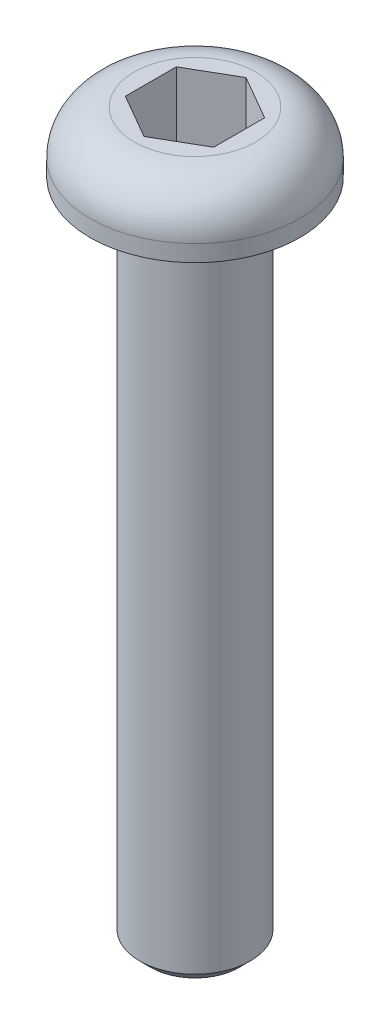
ISO-10303-21;
HEADER;
FILE_DESCRIPTION(('STEP AP214'),'2;1');
FILE_NAME('part.step','',(''),(''),'','','');
FILE_SCHEMA(('AUTOMOTIVE_DESIGN { 1 0 10303 214 1 1 1 1 }'));
ENDSEC;
DATA;
#1=APPLICATION_CONTEXT('core data for automotive mechanical design processes');
#2=APPLICATION_PROTOCOL_DEFINITION('international standard','automotive_design',2000,#1);
#3=PRODUCT_CONTEXT('',#1,'mechanical');
#4=PRODUCT('Part','Part','',(#3));
#5=PRODUCT_RELATED_PRODUCT_CATEGORY('part','',(#4));
#6=PRODUCT_DEFINITION_FORMATION('','',#4);
#7=PRODUCT_DEFINITION_CONTEXT('part definition',#1,'design');
#8=PRODUCT_DEFINITION('design','',#6,#7);
#9=PRODUCT_DEFINITION_SHAPE('','',#8);
#10=(LENGTH_UNIT() NAMED_UNIT(*) SI_UNIT(.MILLI.,.METRE.));
#11=(NAMED_UNIT(*) PLANE_ANGLE_UNIT() SI_UNIT($,.RADIAN.));
#12=(NAMED_UNIT(*) SI_UNIT($,.STERADIAN.) SOLID_ANGLE_UNIT());
#13=UNCERTAINTY_MEASURE_WITH_UNIT(LENGTH_MEASURE(1.E-05),#10,'distance_accuracy_value','');
#14=(GEOMETRIC_REPRESENTATION_CONTEXT(3) GLOBAL_UNCERTAINTY_ASSIGNED_CONTEXT((#13)) GLOBAL_UNIT_ASSIGNED_CONTEXT((#10,
#11,#12)) REPRESENTATION_CONTEXT('',''));
#15=CARTESIAN_POINT('',(0.,0.,0.));
#16=DIRECTION('',(0.,0.,1.));
#17=DIRECTION('',(1.,0.,0.));
#18=AXIS2_PLACEMENT_3D('',#15,#16,#17);
#19=CARTESIAN_POINT('',(0.,0.,0.));
#20=DIRECTION('',(0.,-1.,0.));
#21=DIRECTION('',(0.,0.,-1.));
#22=AXIS2_PLACEMENT_3D('',#19,#20,#21);
#23=PLANE('',#22);
#24=CARTESIAN_POINT('',(0.,0.,0.));
#25=DIRECTION('',(0.,-1.,0.));
#26=DIRECTION('',(0.,0.,-1.));
#27=AXIS2_PLACEMENT_3D('',#24,#25,#26);
#28=CIRCLE('',#27,2.75);
#29=CARTESIAN_POINT('',(0.,0.,-2.75));
#30=VERTEX_POINT('',#29);
#31=EDGE_CURVE('E43',#30,#30,#28,.F.);
#32=ORIENTED_EDGE('',*,*,#31,.T.);
#33=EDGE_LOOP('',(#32));
#34=FACE_BOUND('',#33,.T.);
#35=DIRECTION('',(-0.866025403784438,0.,-0.5));
#36=VECTOR('',#35,1.);
#37=CARTESIAN_POINT('',(2.,0.,-1.15470053837925));
#38=LINE('',#37,#36);
#39=CARTESIAN_POINT('',(2.,0.,-1.15470053837925));
#40=VERTEX_POINT('',#39);
#41=CARTESIAN_POINT('',(0.,0.,-2.3094010767585));
#42=VERTEX_POINT('',#41);
#43=EDGE_CURVE('E124',#40,#42,#38,.T.);
#44=ORIENTED_EDGE('',*,*,#43,.F.);
#45=DIRECTION('',(0.,0.,-1.));
#46=VECTOR('',#45,1.);
#47=CARTESIAN_POINT('',(2.,0.,1.15470053837925));
#48=LINE('',#47,#46);
#49=CARTESIAN_POINT('',(2.,0.,1.15470053837925));
#50=VERTEX_POINT('',#49);
#51=EDGE_CURVE('E50',#50,#40,#48,.T.);
#52=ORIENTED_EDGE('',*,*,#51,.F.);
#53=DIRECTION('',(0.866025403784438,0.,-0.5));
#54=VECTOR('',#53,1.);
#55=CARTESIAN_POINT('',(0.,0.,2.3094010767585));
#56=LINE('',#55,#54);
#57=CARTESIAN_POINT('',(0.,0.,2.3094010767585));
#58=VERTEX_POINT('',#57);
#59=EDGE_CURVE('E133',#58,#50,#56,.T.);
#60=ORIENTED_EDGE('',*,*,#59,.F.);
#61=DIRECTION('',(0.866025403784438,0.,0.5));
#62=VECTOR('',#61,1.);
#63=CARTESIAN_POINT('',(-2.,0.,1.15470053837925));
#64=LINE('',#63,#62);
#65=CARTESIAN_POINT('',(-2.,0.,1.15470053837925));
#66=VERTEX_POINT('',#65);
#67=EDGE_CURVE('E131',#66,#58,#64,.T.);
#68=ORIENTED_EDGE('',*,*,#67,.F.);
#69=DIRECTION('',(0.,0.,1.));
#70=VECTOR('',#69,1.);
#71=CARTESIAN_POINT('',(-2.,0.,-1.15470053837925));
#72=LINE('',#71,#70);
#73=CARTESIAN_POINT('',(-2.,0.,-1.15470053837925));
#74=VERTEX_POINT('',#73);
#75=EDGE_CURVE('E98',#74,#66,#72,.T.);
#76=ORIENTED_EDGE('',*,*,#75,.F.);
#77=DIRECTION('',(-0.866025403784439,0.,0.5));
#78=VECTOR('',#77,1.);
#79=CARTESIAN_POINT('',(0.,0.,-2.3094010767585));
#80=LINE('',#79,#78);
#81=EDGE_CURVE('E127',#42,#74,#80,.T.);
#82=ORIENTED_EDGE('',*,*,#81,.F.);
#83=EDGE_LOOP('',(#44,#52,#60,#68,#76,#82));
#84=FACE_BOUND('',#83,.T.);
#85=ADVANCED_FACE('F35',(#34,#84),#23,.F.);
#86=CARTESIAN_POINT('',(0.,0.,0.));
#87=DIRECTION('',(0.,1.,0.));
#88=DIRECTION('',(0.,0.,1.));
#89=AXIS2_PLACEMENT_3D('',#86,#87,#88);
#90=CYLINDRICAL_SURFACE('',#89,4.75);
#91=CARTESIAN_POINT('',(0.,-2.,0.));
#92=DIRECTION('',(0.,-1.,0.));
#93=DIRECTION('',(0.,0.,-1.));
#94=AXIS2_PLACEMENT_3D('',#91,#92,#93);
#95=CIRCLE('',#94,4.75);
#96=CARTESIAN_POINT('',(0.,-2.,-4.75));
#97=VERTEX_POINT('',#96);
#98=EDGE_CURVE('E11',#97,#97,#95,.T.);
#99=ORIENTED_EDGE('',*,*,#98,.T.);
#100=EDGE_LOOP('',(#99));
#101=FACE_BOUND('',#100,.T.);
#102=CARTESIAN_POINT('',(0.,-2.75,0.));
#103=DIRECTION('',(0.,1.,0.));
#104=DIRECTION('',(0.,0.,1.));
#105=AXIS2_PLACEMENT_3D('',#102,#103,#104);
#106=CIRCLE('',#105,4.75);
#107=CARTESIAN_POINT('',(0.,-2.75,4.75));
#108=VERTEX_POINT('',#107);
#109=EDGE_CURVE('E145',#108,#108,#106,.T.);
#110=ORIENTED_EDGE('',*,*,#109,.T.);
#111=EDGE_LOOP('',(#110));
#112=FACE_BOUND('',#111,.T.);
#113=ADVANCED_FACE('F167',(#101,#112),#90,.T.);
#114=CARTESIAN_POINT('',(4.75,-2.75,0.));
#115=DIRECTION('',(0.,1.,0.));
#116=DIRECTION('',(0.,0.,1.));
#117=AXIS2_PLACEMENT_3D('',#114,#115,#116);
#118=PLANE('',#117);
#119=ORIENTED_EDGE('',*,*,#109,.F.);
#120=EDGE_LOOP('',(#119));
#121=FACE_BOUND('',#120,.T.);
#122=CARTESIAN_POINT('',(0.,-2.75,0.));
#123=DIRECTION('',(0.,1.,0.));
#124=DIRECTION('',(0.,0.,1.));
#125=AXIS2_PLACEMENT_3D('',#122,#123,#124);
#126=CIRCLE('',#125,2.5);
#127=CARTESIAN_POINT('',(0.,-2.75,2.5));
#128=VERTEX_POINT('',#127);
#129=EDGE_CURVE('E137',#128,#128,#126,.T.);
#130=ORIENTED_EDGE('',*,*,#129,.T.);
#131=EDGE_LOOP('',(#130));
#132=FACE_BOUND('',#131,.T.);
#133=ADVANCED_FACE('F172',(#121,#132),#118,.F.);
#134=CARTESIAN_POINT('',(0.,0.,0.));
#135=DIRECTION('',(0.,1.,0.));
#136=DIRECTION('',(0.,0.,1.));
#137=AXIS2_PLACEMENT_3D('',#134,#135,#136);
#138=CYLINDRICAL_SURFACE('',#137,2.5);
#139=CARTESIAN_POINT('',(0.,-32.25,0.));
#140=DIRECTION('',(0.,1.,0.));
#141=DIRECTION('',(0.,0.,1.));
#142=AXIS2_PLACEMENT_3D('',#139,#140,#141);
#143=CIRCLE('',#142,2.5);
#144=CARTESIAN_POINT('',(0.,-32.25,2.5));
#145=VERTEX_POINT('',#144);
#146=EDGE_CURVE('E148',#145,#145,#143,.T.);
#147=ORIENTED_EDGE('',*,*,#146,.T.);
#148=EDGE_LOOP('',(#147));
#149=FACE_BOUND('',#148,.T.);
#150=ORIENTED_EDGE('',*,*,#129,.F.);
#151=EDGE_LOOP('',(#150));
#152=FACE_BOUND('',#151,.T.);
#153=ADVANCED_FACE('F178',(#149,#152),#138,.T.);
#154=CARTESIAN_POINT('',(2.5,-32.75,0.));
#155=DIRECTION('',(0.,1.,0.));
#156=DIRECTION('',(0.,0.,1.));
#157=AXIS2_PLACEMENT_3D('',#154,#155,#156);
#158=PLANE('',#157);
#159=CARTESIAN_POINT('',(0.,-32.75,0.));
#160=DIRECTION('',(0.,1.,0.));
#161=DIRECTION('',(0.,0.,1.));
#162=AXIS2_PLACEMENT_3D('',#159,#160,#161);
#163=CIRCLE('',#162,2.00000000000001);
#164=CARTESIAN_POINT('',(0.,-32.75,2.00000000000001));
#165=VERTEX_POINT('',#164);
#166=EDGE_CURVE('E151',#165,#165,#163,.F.);
#167=ORIENTED_EDGE('',*,*,#166,.T.);
#168=EDGE_LOOP('',(#167));
#169=FACE_BOUND('',#168,.T.);
#170=ADVANCED_FACE('F182',(#169),#158,.F.);
#171=CARTESIAN_POINT('',(2.,-3.5,1.15470053837925));
#172=DIRECTION('',(1.,0.,0.));
#173=DIRECTION('',(0.,0.,-1.));
#174=AXIS2_PLACEMENT_3D('',#171,#172,#173);
#175=PLANE('',#174);
#176=ORIENTED_EDGE('',*,*,#51,.T.);
#177=DIRECTION('',(0.,1.,0.));
#178=VECTOR('',#177,1.);
#179=CARTESIAN_POINT('',(2.,-3.5,-1.15470053837925));
#180=LINE('',#179,#178);
#181=CARTESIAN_POINT('',(2.,-3.5,-1.15470053837925));
#182=VERTEX_POINT('',#181);
#183=EDGE_CURVE('E80',#182,#40,#180,.T.);
#184=ORIENTED_EDGE('',*,*,#183,.F.);
#185=DIRECTION('',(0.,0.,-1.));
#186=VECTOR('',#185,1.);
#187=CARTESIAN_POINT('',(2.,-3.5,1.15470053837925));
#188=LINE('',#187,#186);
#189=CARTESIAN_POINT('',(2.,-3.5,1.15470053837925));
#190=VERTEX_POINT('',#189);
#191=EDGE_CURVE('E135',#190,#182,#188,.T.);
#192=ORIENTED_EDGE('',*,*,#191,.F.);
#193=DIRECTION('',(0.,1.,0.));
#194=VECTOR('',#193,1.);
#195=CARTESIAN_POINT('',(2.,-3.5,1.15470053837925));
#196=LINE('',#195,#194);
#197=EDGE_CURVE('E58',#190,#50,#196,.T.);
#198=ORIENTED_EDGE('',*,*,#197,.T.);
#199=EDGE_LOOP('',(#176,#184,#192,#198));
#200=FACE_BOUND('',#199,.T.);
#201=ADVANCED_FACE('F186',(#200),#175,.F.);
#202=CARTESIAN_POINT('',(0.,-3.5,2.3094010767585));
#203=DIRECTION('',(0.5,0.,0.866025403784438));
#204=DIRECTION('',(0.866025403784439,0.,-0.5));
#205=AXIS2_PLACEMENT_3D('',#202,#203,#204);
#206=PLANE('',#205);
#207=ORIENTED_EDGE('',*,*,#59,.T.);
#208=ORIENTED_EDGE('',*,*,#197,.F.);
#209=DIRECTION('',(0.866025403784438,0.,-0.5));
#210=VECTOR('',#209,1.);
#211=CARTESIAN_POINT('',(0.,-3.5,2.3094010767585));
#212=LINE('',#211,#210);
#213=CARTESIAN_POINT('',(0.,-3.5,2.3094010767585));
#214=VERTEX_POINT('',#213);
#215=EDGE_CURVE('E110',#214,#190,#212,.T.);
#216=ORIENTED_EDGE('',*,*,#215,.F.);
#217=DIRECTION('',(0.,1.,0.));
#218=VECTOR('',#217,1.);
#219=CARTESIAN_POINT('',(0.,-3.5,2.3094010767585));
#220=LINE('',#219,#218);
#221=EDGE_CURVE('E102',#214,#58,#220,.T.);
#222=ORIENTED_EDGE('',*,*,#221,.T.);
#223=EDGE_LOOP('',(#207,#208,#216,#222));
#224=FACE_BOUND('',#223,.T.);
#225=ADVANCED_FACE('F190',(#224),#206,.F.);
#226=CARTESIAN_POINT('',(-2.,-3.5,1.15470053837925));
#227=DIRECTION('',(-0.5,0.,0.866025403784438));
#228=DIRECTION('',(0.866025403784439,0.,0.5));
#229=AXIS2_PLACEMENT_3D('',#226,#227,#228);
#230=PLANE('',#229);
#231=ORIENTED_EDGE('',*,*,#67,.T.);
#232=ORIENTED_EDGE('',*,*,#221,.F.);
#233=DIRECTION('',(0.866025403784438,0.,0.5));
#234=VECTOR('',#233,1.);
#235=CARTESIAN_POINT('',(-2.,-3.5,1.15470053837925));
#236=LINE('',#235,#234);
#237=CARTESIAN_POINT('',(-2.,-3.5,1.15470053837925));
#238=VERTEX_POINT('',#237);
#239=EDGE_CURVE('E106',#238,#214,#236,.T.);
#240=ORIENTED_EDGE('',*,*,#239,.F.);
#241=DIRECTION('',(0.,1.,0.));
#242=VECTOR('',#241,1.);
#243=CARTESIAN_POINT('',(-2.,-3.5,1.15470053837925));
#244=LINE('',#243,#242);
#245=EDGE_CURVE('E91',#238,#66,#244,.T.);
#246=ORIENTED_EDGE('',*,*,#245,.T.);
#247=EDGE_LOOP('',(#231,#232,#240,#246));
#248=FACE_BOUND('',#247,.T.);
#249=ADVANCED_FACE('F107',(#248),#230,.F.);
#250=CARTESIAN_POINT('',(-2.,-3.5,-1.15470053837925));
#251=DIRECTION('',(-1.,0.,0.));
#252=DIRECTION('',(0.,0.,1.));
#253=AXIS2_PLACEMENT_3D('',#250,#251,#252);
#254=PLANE('',#253);
#255=ORIENTED_EDGE('',*,*,#75,.T.);
#256=ORIENTED_EDGE('',*,*,#245,.F.);
#257=DIRECTION('',(0.,0.,1.));
#258=VECTOR('',#257,1.);
#259=CARTESIAN_POINT('',(-2.,-3.5,-1.15470053837925));
#260=LINE('',#259,#258);
#261=CARTESIAN_POINT('',(-2.,-3.5,-1.15470053837925));
#262=VERTEX_POINT('',#261);
#263=EDGE_CURVE('E95',#262,#238,#260,.T.);
#264=ORIENTED_EDGE('',*,*,#263,.F.);
#265=DIRECTION('',(0.,1.,0.));
#266=VECTOR('',#265,1.);
#267=CARTESIAN_POINT('',(-2.,-3.5,-1.15470053837925));
#268=LINE('',#267,#266);
#269=EDGE_CURVE('E103',#262,#74,#268,.T.);
#270=ORIENTED_EDGE('',*,*,#269,.T.);
#271=EDGE_LOOP('',(#255,#256,#264,#270));
#272=FACE_BOUND('',#271,.T.);
#273=ADVANCED_FACE('F93',(#272),#254,.F.);
#274=CARTESIAN_POINT('',(0.,-3.5,-2.3094010767585));
#275=DIRECTION('',(-0.5,0.,-0.866025403784439));
#276=DIRECTION('',(-0.866025403784439,0.,0.5));
#277=AXIS2_PLACEMENT_3D('',#274,#275,#276);
#278=PLANE('',#277);
#279=ORIENTED_EDGE('',*,*,#81,.T.);
#280=ORIENTED_EDGE('',*,*,#269,.F.);
#281=DIRECTION('',(-0.866025403784439,0.,0.5));
#282=VECTOR('',#281,1.);
#283=CARTESIAN_POINT('',(0.,-3.5,-2.3094010767585));
#284=LINE('',#283,#282);
#285=CARTESIAN_POINT('',(0.,-3.5,-2.3094010767585));
#286=VERTEX_POINT('',#285);
#287=EDGE_CURVE('E116',#286,#262,#284,.T.);
#288=ORIENTED_EDGE('',*,*,#287,.F.);
#289=DIRECTION('',(0.,1.,0.));
#290=VECTOR('',#289,1.);
#291=CARTESIAN_POINT('',(0.,-3.5,-2.3094010767585));
#292=LINE('',#291,#290);
#293=EDGE_CURVE('E140',#286,#42,#292,.T.);
#294=ORIENTED_EDGE('',*,*,#293,.T.);
#295=EDGE_LOOP('',(#279,#280,#288,#294));
#296=FACE_BOUND('',#295,.T.);
#297=ADVANCED_FACE('F194',(#296),#278,.F.);
#298=CARTESIAN_POINT('',(2.,-3.5,-1.15470053837925));
#299=DIRECTION('',(0.5,0.,-0.866025403784438));
#300=DIRECTION('',(-0.866025403784439,0.,-0.5));
#301=AXIS2_PLACEMENT_3D('',#298,#299,#300);
#302=PLANE('',#301);
#303=ORIENTED_EDGE('',*,*,#43,.T.);
#304=ORIENTED_EDGE('',*,*,#293,.F.);
#305=DIRECTION('',(-0.866025403784438,0.,-0.5));
#306=VECTOR('',#305,1.);
#307=CARTESIAN_POINT('',(2.,-3.5,-1.15470053837925));
#308=LINE('',#307,#306);
#309=EDGE_CURVE('E118',#182,#286,#308,.T.);
#310=ORIENTED_EDGE('',*,*,#309,.F.);
#311=ORIENTED_EDGE('',*,*,#183,.T.);
#312=EDGE_LOOP('',(#303,#304,#310,#311));
#313=FACE_BOUND('',#312,.T.);
#314=ADVANCED_FACE('F191',(#313),#302,.F.);
#315=CARTESIAN_POINT('',(2.,-3.5,-1.15470053837925));
#316=DIRECTION('',(0.,1.,0.));
#317=DIRECTION('',(0.,0.,1.));
#318=AXIS2_PLACEMENT_3D('',#315,#316,#317);
#319=PLANE('',#318);
#320=ORIENTED_EDGE('',*,*,#191,.T.);
#321=ORIENTED_EDGE('',*,*,#309,.T.);
#322=ORIENTED_EDGE('',*,*,#287,.T.);
#323=ORIENTED_EDGE('',*,*,#263,.T.);
#324=ORIENTED_EDGE('',*,*,#239,.T.);
#325=ORIENTED_EDGE('',*,*,#215,.T.);
#326=EDGE_LOOP('',(#320,#321,#322,#323,#324,#325));
#327=FACE_BOUND('',#326,.T.);
#328=ADVANCED_FACE('F113',(#327),#319,.T.);
#329=CARTESIAN_POINT('',(0.,-32.25,0.));
#330=DIRECTION('',(0.,1.,0.));
#331=DIRECTION('',(0.,0.,1.));
#332=AXIS2_PLACEMENT_3D('',#329,#330,#331);
#333=CONICAL_SURFACE('',#332,2.5,0.785398163397452);
#334=ORIENTED_EDGE('',*,*,#166,.F.);
#335=EDGE_LOOP('',(#334));
#336=FACE_BOUND('',#335,.T.);
#337=ORIENTED_EDGE('',*,*,#146,.F.);
#338=EDGE_LOOP('',(#337));
#339=FACE_BOUND('',#338,.T.);
#340=ADVANCED_FACE('F159',(#336,#339),#333,.T.);
#341=CARTESIAN_POINT('',(0.,-2.,0.));
#342=DIRECTION('',(0.,-1.,0.));
#343=DIRECTION('',(0.,0.,-1.));
#344=AXIS2_PLACEMENT_3D('',#341,#342,#343);
#345=TOROIDAL_SURFACE('',#344,2.75,2.);
#346=ORIENTED_EDGE('',*,*,#98,.F.);
#347=EDGE_LOOP('',(#346));
#348=FACE_BOUND('',#347,.T.);
#349=ORIENTED_EDGE('',*,*,#31,.F.);
#350=EDGE_LOOP('',(#349));
#351=FACE_BOUND('',#350,.T.);
#352=ADVANCED_FACE('F37',(#348,#351),#345,.T.);
#353=CLOSED_SHELL('',(#85,#113,#133,#153,#170,#201,#225,#249,#273,#297,#314,#328,#340,#352));
#354=MANIFOLD_SOLID_BREP('B2',#353);
#355=ADVANCED_BREP_SHAPE_REPRESENTATION('',(#18,#354),#14);
#356=SHAPE_DEFINITION_REPRESENTATION(#9,#355);
ENDSEC;
END-ISO-10303-21;
